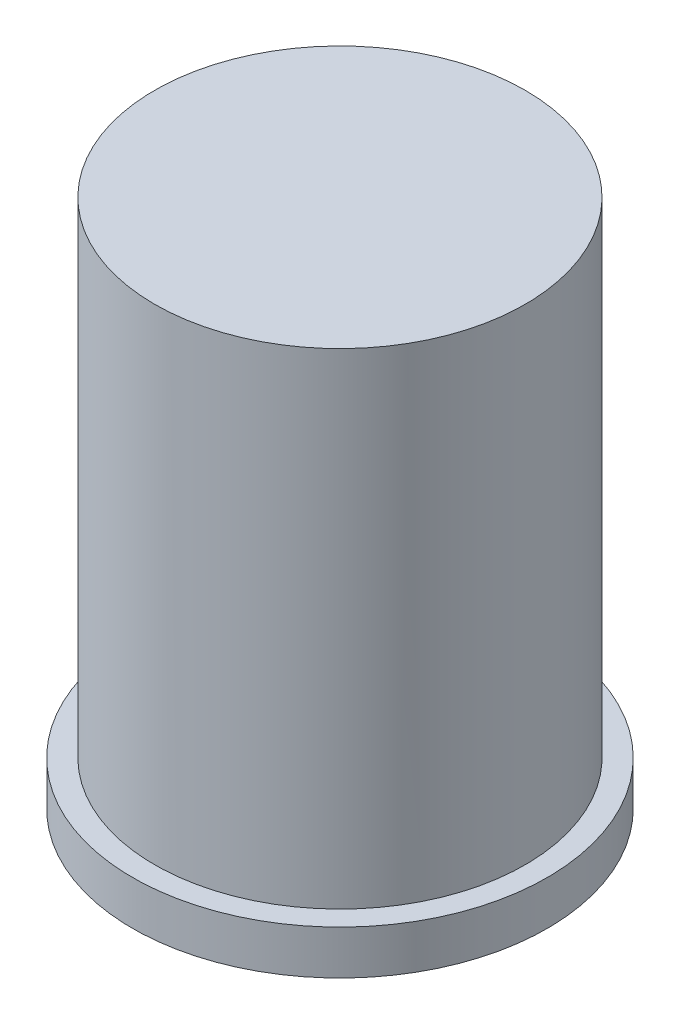
ISO-10303-21;
HEADER;
FILE_DESCRIPTION(('STEP AP214'),'2;1');
FILE_NAME('part.step','',(''),(''),'','','');
FILE_SCHEMA(('AUTOMOTIVE_DESIGN { 1 0 10303 214 1 1 1 1 }'));
ENDSEC;
DATA;
#1=APPLICATION_CONTEXT('core data for automotive mechanical design processes');
#2=APPLICATION_PROTOCOL_DEFINITION('international standard','automotive_design',2000,#1);
#3=PRODUCT_CONTEXT('',#1,'mechanical');
#4=PRODUCT('Part','Part','',(#3));
#5=PRODUCT_RELATED_PRODUCT_CATEGORY('part','',(#4));
#6=PRODUCT_DEFINITION_FORMATION('','',#4);
#7=PRODUCT_DEFINITION_CONTEXT('part definition',#1,'design');
#8=PRODUCT_DEFINITION('design','',#6,#7);
#9=PRODUCT_DEFINITION_SHAPE('','',#8);
#10=(LENGTH_UNIT() NAMED_UNIT(*) SI_UNIT(.MILLI.,.METRE.));
#11=(NAMED_UNIT(*) PLANE_ANGLE_UNIT() SI_UNIT($,.RADIAN.));
#12=(NAMED_UNIT(*) SI_UNIT($,.STERADIAN.) SOLID_ANGLE_UNIT());
#13=UNCERTAINTY_MEASURE_WITH_UNIT(LENGTH_MEASURE(1.E-05),#10,'distance_accuracy_value','');
#14=(GEOMETRIC_REPRESENTATION_CONTEXT(3) GLOBAL_UNCERTAINTY_ASSIGNED_CONTEXT((#13)) GLOBAL_UNIT_ASSIGNED_CONTEXT((#10,
#11,#12)) REPRESENTATION_CONTEXT('',''));
#15=CARTESIAN_POINT('',(0.,0.,0.));
#16=DIRECTION('',(0.,0.,1.));
#17=DIRECTION('',(1.,0.,0.));
#18=AXIS2_PLACEMENT_3D('',#15,#16,#17);
#19=CARTESIAN_POINT('',(0.,120.,0.));
#20=DIRECTION('',(0.,-1.,0.));
#21=DIRECTION('',(0.,0.,-1.));
#22=AXIS2_PLACEMENT_3D('',#19,#20,#21);
#23=CYLINDRICAL_SURFACE('',#22,42.);
#24=CARTESIAN_POINT('',(0.,120.,0.));
#25=DIRECTION('',(0.,1.,0.));
#26=DIRECTION('',(0.,0.,1.));
#27=AXIS2_PLACEMENT_3D('',#24,#25,#26);
#28=CIRCLE('',#27,42.);
#29=CARTESIAN_POINT('',(0.,120.,42.));
#30=VERTEX_POINT('',#29);
#31=EDGE_CURVE('E41',#30,#30,#28,.T.);
#32=ORIENTED_EDGE('',*,*,#31,.F.);
#33=EDGE_LOOP('',(#32));
#34=FACE_BOUND('',#33,.T.);
#35=CARTESIAN_POINT('',(0.,9.99999999999999,0.));
#36=DIRECTION('',(0.,-1.,0.));
#37=DIRECTION('',(0.,0.,-1.));
#38=AXIS2_PLACEMENT_3D('',#35,#36,#37);
#39=CIRCLE('',#38,42.);
#40=CARTESIAN_POINT('',(0.,9.99999999999999,-42.));
#41=VERTEX_POINT('',#40);
#42=EDGE_CURVE('E10',#41,#41,#39,.T.);
#43=ORIENTED_EDGE('',*,*,#42,.F.);
#44=EDGE_LOOP('',(#43));
#45=FACE_BOUND('',#44,.T.);
#46=ADVANCED_FACE('F35',(#34,#45),#23,.T.);
#47=CARTESIAN_POINT('',(0.,120.,0.));
#48=DIRECTION('',(0.,1.,0.));
#49=DIRECTION('',(0.,0.,1.));
#50=AXIS2_PLACEMENT_3D('',#47,#48,#49);
#51=PLANE('',#50);
#52=ORIENTED_EDGE('',*,*,#31,.T.);
#53=EDGE_LOOP('',(#52));
#54=FACE_BOUND('',#53,.T.);
#55=ADVANCED_FACE('F60',(#54),#51,.T.);
#56=CARTESIAN_POINT('',(0.,10.,0.));
#57=DIRECTION('',(0.,-1.,0.));
#58=DIRECTION('',(0.,0.,-1.));
#59=AXIS2_PLACEMENT_3D('',#56,#57,#58);
#60=CYLINDRICAL_SURFACE('',#59,47.);
#61=CARTESIAN_POINT('',(0.,10.,0.));
#62=DIRECTION('',(0.,-1.,0.));
#63=DIRECTION('',(0.,0.,-1.));
#64=AXIS2_PLACEMENT_3D('',#61,#62,#63);
#65=CIRCLE('',#64,47.);
#66=CARTESIAN_POINT('',(0.,10.,-47.));
#67=VERTEX_POINT('',#66);
#68=EDGE_CURVE('E45',#67,#67,#65,.T.);
#69=ORIENTED_EDGE('',*,*,#68,.T.);
#70=EDGE_LOOP('',(#69));
#71=FACE_BOUND('',#70,.T.);
#72=CARTESIAN_POINT('',(0.,0.,0.));
#73=DIRECTION('',(0.,-1.,0.));
#74=DIRECTION('',(0.,0.,-1.));
#75=AXIS2_PLACEMENT_3D('',#72,#73,#74);
#76=CIRCLE('',#75,47.);
#77=CARTESIAN_POINT('',(0.,0.,-47.));
#78=VERTEX_POINT('',#77);
#79=EDGE_CURVE('E49',#78,#78,#76,.T.);
#80=ORIENTED_EDGE('',*,*,#79,.F.);
#81=EDGE_LOOP('',(#80));
#82=FACE_BOUND('',#81,.T.);
#83=ADVANCED_FACE('F57',(#71,#82),#60,.T.);
#84=CARTESIAN_POINT('',(0.,10.,0.));
#85=DIRECTION('',(0.,-1.,0.));
#86=DIRECTION('',(0.,0.,-1.));
#87=AXIS2_PLACEMENT_3D('',#84,#85,#86);
#88=PLANE('',#87);
#89=ORIENTED_EDGE('',*,*,#42,.T.);
#90=EDGE_LOOP('',(#89));
#91=FACE_BOUND('',#90,.T.);
#92=ORIENTED_EDGE('',*,*,#68,.F.);
#93=EDGE_LOOP('',(#92));
#94=FACE_BOUND('',#93,.T.);
#95=ADVANCED_FACE('F59',(#91,#94),#88,.F.);
#96=CARTESIAN_POINT('',(0.,0.,0.));
#97=DIRECTION('',(0.,1.,0.));
#98=DIRECTION('',(0.,0.,1.));
#99=AXIS2_PLACEMENT_3D('',#96,#97,#98);
#100=PLANE('',#99);
#101=ORIENTED_EDGE('',*,*,#79,.T.);
#102=EDGE_LOOP('',(#101));
#103=FACE_BOUND('',#102,.T.);
#104=ADVANCED_FACE('F55',(#103),#100,.F.);
#105=CLOSED_SHELL('',(#46,#55,#83,#95,#104));
#106=MANIFOLD_SOLID_BREP('B2',#105);
#107=ADVANCED_BREP_SHAPE_REPRESENTATION('',(#18,#106),#14);
#108=SHAPE_DEFINITION_REPRESENTATION(#9,#107);
ENDSEC;
END-ISO-10303-21;
